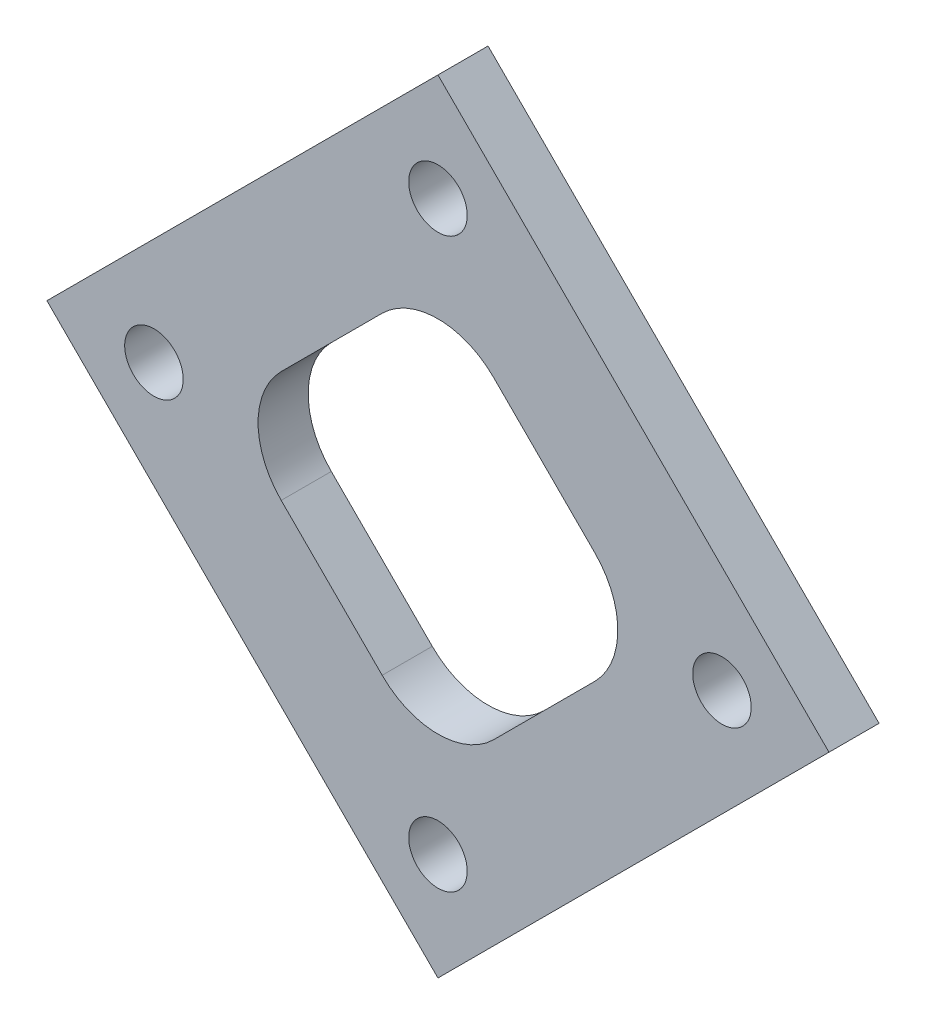
ISO-10303-21;
HEADER;
FILE_DESCRIPTION(('STEP AP214'),'2;1');
FILE_NAME('part.step','',(''),(''),'','','');
FILE_SCHEMA(('AUTOMOTIVE_DESIGN { 1 0 10303 214 1 1 1 1 }'));
ENDSEC;
DATA;
#1=APPLICATION_CONTEXT('core data for automotive mechanical design processes');
#2=APPLICATION_PROTOCOL_DEFINITION('international standard','automotive_design',2000,#1);
#3=PRODUCT_CONTEXT('',#1,'mechanical');
#4=PRODUCT('Part','Part','',(#3));
#5=PRODUCT_RELATED_PRODUCT_CATEGORY('part','',(#4));
#6=PRODUCT_DEFINITION_FORMATION('','',#4);
#7=PRODUCT_DEFINITION_CONTEXT('part definition',#1,'design');
#8=PRODUCT_DEFINITION('design','',#6,#7);
#9=PRODUCT_DEFINITION_SHAPE('','',#8);
#10=(LENGTH_UNIT() NAMED_UNIT(*) SI_UNIT(.MILLI.,.METRE.));
#11=(NAMED_UNIT(*) PLANE_ANGLE_UNIT() SI_UNIT($,.RADIAN.));
#12=(NAMED_UNIT(*) SI_UNIT($,.STERADIAN.) SOLID_ANGLE_UNIT());
#13=UNCERTAINTY_MEASURE_WITH_UNIT(LENGTH_MEASURE(1.E-05),#10,'distance_accuracy_value','');
#14=(GEOMETRIC_REPRESENTATION_CONTEXT(3) GLOBAL_UNCERTAINTY_ASSIGNED_CONTEXT((#13)) GLOBAL_UNIT_ASSIGNED_CONTEXT((#10,
#11,#12)) REPRESENTATION_CONTEXT('',''));
#15=CARTESIAN_POINT('',(0.,0.,0.));
#16=DIRECTION('',(0.,0.,1.));
#17=DIRECTION('',(1.,0.,0.));
#18=AXIS2_PLACEMENT_3D('',#15,#16,#17);
#19=CARTESIAN_POINT('',(0.,0.,3.175));
#20=DIRECTION('',(0.,0.,1.));
#21=DIRECTION('',(1.,0.,0.));
#22=AXIS2_PLACEMENT_3D('',#19,#20,#21);
#23=PLANE('',#22);
#24=CARTESIAN_POINT('',(0.,-18.,3.175));
#25=DIRECTION('',(0.,0.,1.));
#26=DIRECTION('',(1.,0.,0.));
#27=AXIS2_PLACEMENT_3D('',#24,#25,#26);
#28=CIRCLE('',#27,1.8542);
#29=CARTESIAN_POINT('',(1.8542,-18.,3.175));
#30=VERTEX_POINT('',#29);
#31=EDGE_CURVE('E298',#30,#30,#28,.T.);
#32=ORIENTED_EDGE('',*,*,#31,.F.);
#33=EDGE_LOOP('',(#32));
#34=FACE_BOUND('',#33,.T.);
#35=CARTESIAN_POINT('',(0.,18.,3.175));
#36=DIRECTION('',(0.,0.,1.));
#37=DIRECTION('',(1.,0.,0.));
#38=AXIS2_PLACEMENT_3D('',#35,#36,#37);
#39=CIRCLE('',#38,1.8542);
#40=CARTESIAN_POINT('',(1.8542,18.,3.175));
#41=VERTEX_POINT('',#40);
#42=EDGE_CURVE('E197',#41,#41,#39,.T.);
#43=ORIENTED_EDGE('',*,*,#42,.F.);
#44=EDGE_LOOP('',(#43));
#45=FACE_BOUND('',#44,.T.);
#46=DIRECTION('',(-0.707106781186548,-0.707106781186548,0.));
#47=VECTOR('',#46,1.);
#48=CARTESIAN_POINT('',(0.,24.7840926805885,3.175));
#49=LINE('',#48,#47);
#50=CARTESIAN_POINT('',(0.,24.7840926805885,3.175));
#51=VERTEX_POINT('',#50);
#52=CARTESIAN_POINT('',(-24.7840926805885,0.,3.175));
#53=VERTEX_POINT('',#52);
#54=EDGE_CURVE('E133',#51,#53,#49,.T.);
#55=ORIENTED_EDGE('',*,*,#54,.T.);
#56=DIRECTION('',(0.707106781186547,-0.707106781186548,0.));
#57=VECTOR('',#56,1.);
#58=CARTESIAN_POINT('',(-24.7840926805885,0.,3.175));
#59=LINE('',#58,#57);
#60=CARTESIAN_POINT('',(0.,-24.7840926805885,3.175));
#61=VERTEX_POINT('',#60);
#62=EDGE_CURVE('E122',#53,#61,#59,.T.);
#63=ORIENTED_EDGE('',*,*,#62,.T.);
#64=DIRECTION('',(0.707106781186547,0.707106781186548,0.));
#65=VECTOR('',#64,1.);
#66=CARTESIAN_POINT('',(24.7840926805885,0.,3.175));
#67=LINE('',#66,#65);
#68=CARTESIAN_POINT('',(24.7840926805885,0.,3.175));
#69=VERTEX_POINT('',#68);
#70=EDGE_CURVE('E132',#61,#69,#67,.T.);
#71=ORIENTED_EDGE('',*,*,#70,.T.);
#72=DIRECTION('',(-0.707106781186547,0.707106781186548,0.));
#73=VECTOR('',#72,1.);
#74=CARTESIAN_POINT('',(0.,24.7840926805885,3.175));
#75=LINE('',#74,#73);
#76=EDGE_CURVE('E137',#69,#51,#75,.T.);
#77=ORIENTED_EDGE('',*,*,#76,.T.);
#78=EDGE_LOOP('',(#55,#63,#71,#77));
#79=FACE_BOUND('',#78,.T.);
#80=DIRECTION('',(0.707106781186547,-0.707106781186548,0.));
#81=VECTOR('',#80,1.);
#82=CARTESIAN_POINT('',(-13.4703841816037,0.,3.175));
#83=LINE('',#82,#81);
#84=CARTESIAN_POINT('',(-9.93485027567099,-3.53553390593274,3.175));
#85=VERTEX_POINT('',#84);
#86=CARTESIAN_POINT('',(-3.53553390593274,-9.934850275671,3.175));
#87=VERTEX_POINT('',#86);
#88=EDGE_CURVE('E207',#85,#87,#83,.T.);
#89=ORIENTED_EDGE('',*,*,#88,.F.);
#90=CARTESIAN_POINT('',(-6.39931636973826,0.,3.175));
#91=DIRECTION('',(0.,0.,1.));
#92=DIRECTION('',(1.,0.,0.));
#93=AXIS2_PLACEMENT_3D('',#90,#91,#92);
#94=CIRCLE('',#93,5.);
#95=CARTESIAN_POINT('',(-9.93485027567099,3.53553390593274,3.175));
#96=VERTEX_POINT('',#95);
#97=EDGE_CURVE('E172',#85,#96,#94,.F.);
#98=ORIENTED_EDGE('',*,*,#97,.T.);
#99=DIRECTION('',(-0.707106781186547,-0.707106781186547,0.));
#100=VECTOR('',#99,1.);
#101=CARTESIAN_POINT('',(0.,13.4703841816037,3.175));
#102=LINE('',#101,#100);
#103=CARTESIAN_POINT('',(-3.53553390593274,9.93485027567099,3.175));
#104=VERTEX_POINT('',#103);
#105=EDGE_CURVE('E216',#104,#96,#102,.T.);
#106=ORIENTED_EDGE('',*,*,#105,.F.);
#107=CARTESIAN_POINT('',(0.,6.39931636973825,3.175));
#108=DIRECTION('',(0.,0.,1.));
#109=DIRECTION('',(1.,0.,0.));
#110=AXIS2_PLACEMENT_3D('',#107,#108,#109);
#111=CIRCLE('',#110,5.);
#112=CARTESIAN_POINT('',(3.53553390593274,9.93485027567099,3.175));
#113=VERTEX_POINT('',#112);
#114=EDGE_CURVE('E11',#104,#113,#111,.F.);
#115=ORIENTED_EDGE('',*,*,#114,.T.);
#116=DIRECTION('',(-0.707106781186547,0.707106781186548,0.));
#117=VECTOR('',#116,1.);
#118=CARTESIAN_POINT('',(0.,13.4703841816037,3.175));
#119=LINE('',#118,#117);
#120=CARTESIAN_POINT('',(9.93485027567099,3.53553390593274,3.175));
#121=VERTEX_POINT('',#120);
#122=EDGE_CURVE('E200',#121,#113,#119,.T.);
#123=ORIENTED_EDGE('',*,*,#122,.F.);
#124=CARTESIAN_POINT('',(6.39931636973825,0.,3.175));
#125=DIRECTION('',(0.,0.,1.));
#126=DIRECTION('',(1.,0.,0.));
#127=AXIS2_PLACEMENT_3D('',#124,#125,#126);
#128=CIRCLE('',#127,5.);
#129=CARTESIAN_POINT('',(9.93485027567099,-3.53553390593274,3.175));
#130=VERTEX_POINT('',#129);
#131=EDGE_CURVE('E180',#121,#130,#128,.F.);
#132=ORIENTED_EDGE('',*,*,#131,.T.);
#133=DIRECTION('',(0.707106781186547,0.707106781186548,0.));
#134=VECTOR('',#133,1.);
#135=CARTESIAN_POINT('',(13.4703841816037,0.,3.175));
#136=LINE('',#135,#134);
#137=CARTESIAN_POINT('',(3.53553390593274,-9.93485027567099,3.175));
#138=VERTEX_POINT('',#137);
#139=EDGE_CURVE('E202',#138,#130,#136,.T.);
#140=ORIENTED_EDGE('',*,*,#139,.F.);
#141=CARTESIAN_POINT('',(0.,-6.39931636973826,3.175));
#142=DIRECTION('',(0.,0.,1.));
#143=DIRECTION('',(1.,0.,0.));
#144=AXIS2_PLACEMENT_3D('',#141,#142,#143);
#145=CIRCLE('',#144,5.);
#146=EDGE_CURVE('E176',#138,#87,#145,.F.);
#147=ORIENTED_EDGE('',*,*,#146,.T.);
#148=EDGE_LOOP('',(#89,#98,#106,#115,#123,#132,#140,#147));
#149=FACE_BOUND('',#148,.T.);
#150=CARTESIAN_POINT('',(-18.,0.,3.175));
#151=DIRECTION('',(0.,0.,1.));
#152=DIRECTION('',(1.,0.,0.));
#153=AXIS2_PLACEMENT_3D('',#150,#151,#152);
#154=CIRCLE('',#153,1.8542);
#155=CARTESIAN_POINT('',(-16.1458,0.,3.175));
#156=VERTEX_POINT('',#155);
#157=EDGE_CURVE('E304',#156,#156,#154,.T.);
#158=ORIENTED_EDGE('',*,*,#157,.F.);
#159=EDGE_LOOP('',(#158));
#160=FACE_BOUND('',#159,.T.);
#161=CARTESIAN_POINT('',(18.,0.,3.175));
#162=DIRECTION('',(0.,0.,1.));
#163=DIRECTION('',(1.,0.,0.));
#164=AXIS2_PLACEMENT_3D('',#161,#162,#163);
#165=CIRCLE('',#164,1.8542);
#166=CARTESIAN_POINT('',(19.8542,0.,3.175));
#167=VERTEX_POINT('',#166);
#168=EDGE_CURVE('E289',#167,#167,#165,.T.);
#169=ORIENTED_EDGE('',*,*,#168,.F.);
#170=EDGE_LOOP('',(#169));
#171=FACE_BOUND('',#170,.T.);
#172=ADVANCED_FACE('F33',(#34,#45,#79,#149,#160,#171),#23,.T.);
#173=CARTESIAN_POINT('',(0.,0.,0.));
#174=DIRECTION('',(0.,0.,1.));
#175=DIRECTION('',(1.,0.,0.));
#176=AXIS2_PLACEMENT_3D('',#173,#174,#175);
#177=PLANE('',#176);
#178=DIRECTION('',(-0.707106781186548,-0.707106781186548,0.));
#179=VECTOR('',#178,1.);
#180=CARTESIAN_POINT('',(0.,24.7840926805885,0.));
#181=LINE('',#180,#179);
#182=CARTESIAN_POINT('',(0.,24.7840926805885,0.));
#183=VERTEX_POINT('',#182);
#184=CARTESIAN_POINT('',(-24.7840926805885,0.,0.));
#185=VERTEX_POINT('',#184);
#186=EDGE_CURVE('E145',#183,#185,#181,.T.);
#187=ORIENTED_EDGE('',*,*,#186,.F.);
#188=DIRECTION('',(-0.707106781186547,0.707106781186548,0.));
#189=VECTOR('',#188,1.);
#190=CARTESIAN_POINT('',(0.,24.7840926805885,0.));
#191=LINE('',#190,#189);
#192=CARTESIAN_POINT('',(24.7840926805885,0.,0.));
#193=VERTEX_POINT('',#192);
#194=EDGE_CURVE('E141',#193,#183,#191,.T.);
#195=ORIENTED_EDGE('',*,*,#194,.F.);
#196=DIRECTION('',(0.707106781186547,0.707106781186548,0.));
#197=VECTOR('',#196,1.);
#198=CARTESIAN_POINT('',(24.7840926805885,0.,0.));
#199=LINE('',#198,#197);
#200=CARTESIAN_POINT('',(0.,-24.7840926805885,0.));
#201=VERTEX_POINT('',#200);
#202=EDGE_CURVE('E222',#201,#193,#199,.T.);
#203=ORIENTED_EDGE('',*,*,#202,.F.);
#204=DIRECTION('',(0.707106781186547,-0.707106781186548,0.));
#205=VECTOR('',#204,1.);
#206=CARTESIAN_POINT('',(-24.7840926805885,0.,0.));
#207=LINE('',#206,#205);
#208=EDGE_CURVE('E204',#185,#201,#207,.T.);
#209=ORIENTED_EDGE('',*,*,#208,.F.);
#210=EDGE_LOOP('',(#187,#195,#203,#209));
#211=FACE_BOUND('',#210,.T.);
#212=DIRECTION('',(-0.707106781186547,0.707106781186548,0.));
#213=VECTOR('',#212,1.);
#214=CARTESIAN_POINT('',(0.,13.4703841816037,0.));
#215=LINE('',#214,#213);
#216=CARTESIAN_POINT('',(9.93485027567099,3.53553390593274,0.));
#217=VERTEX_POINT('',#216);
#218=CARTESIAN_POINT('',(3.53553390593274,9.93485027567099,0.));
#219=VERTEX_POINT('',#218);
#220=EDGE_CURVE('E188',#217,#219,#215,.T.);
#221=ORIENTED_EDGE('',*,*,#220,.T.);
#222=CARTESIAN_POINT('',(0.,6.39931636973825,0.));
#223=DIRECTION('',(0.,0.,1.));
#224=DIRECTION('',(1.,0.,0.));
#225=AXIS2_PLACEMENT_3D('',#222,#223,#224);
#226=CIRCLE('',#225,5.);
#227=CARTESIAN_POINT('',(-3.53553390593274,9.93485027567099,0.));
#228=VERTEX_POINT('',#227);
#229=EDGE_CURVE('E41',#219,#228,#226,.T.);
#230=ORIENTED_EDGE('',*,*,#229,.T.);
#231=DIRECTION('',(-0.707106781186547,-0.707106781186547,0.));
#232=VECTOR('',#231,1.);
#233=CARTESIAN_POINT('',(0.,13.4703841816037,0.));
#234=LINE('',#233,#232);
#235=CARTESIAN_POINT('',(-9.93485027567099,3.53553390593274,0.));
#236=VERTEX_POINT('',#235);
#237=EDGE_CURVE('E187',#228,#236,#234,.T.);
#238=ORIENTED_EDGE('',*,*,#237,.T.);
#239=CARTESIAN_POINT('',(-6.39931636973826,0.,0.));
#240=DIRECTION('',(0.,0.,1.));
#241=DIRECTION('',(1.,0.,0.));
#242=AXIS2_PLACEMENT_3D('',#239,#240,#241);
#243=CIRCLE('',#242,5.);
#244=CARTESIAN_POINT('',(-9.93485027567099,-3.53553390593274,0.));
#245=VERTEX_POINT('',#244);
#246=EDGE_CURVE('E170',#236,#245,#243,.T.);
#247=ORIENTED_EDGE('',*,*,#246,.T.);
#248=DIRECTION('',(0.707106781186547,-0.707106781186548,0.));
#249=VECTOR('',#248,1.);
#250=CARTESIAN_POINT('',(-13.4703841816037,0.,0.));
#251=LINE('',#250,#249);
#252=CARTESIAN_POINT('',(-3.53553390593274,-9.934850275671,0.));
#253=VERTEX_POINT('',#252);
#254=EDGE_CURVE('E196',#245,#253,#251,.T.);
#255=ORIENTED_EDGE('',*,*,#254,.T.);
#256=CARTESIAN_POINT('',(0.,-6.39931636973826,0.));
#257=DIRECTION('',(0.,0.,1.));
#258=DIRECTION('',(1.,0.,0.));
#259=AXIS2_PLACEMENT_3D('',#256,#257,#258);
#260=CIRCLE('',#259,5.);
#261=CARTESIAN_POINT('',(3.53553390593274,-9.93485027567099,0.));
#262=VERTEX_POINT('',#261);
#263=EDGE_CURVE('E174',#253,#262,#260,.T.);
#264=ORIENTED_EDGE('',*,*,#263,.T.);
#265=DIRECTION('',(0.707106781186547,0.707106781186548,0.));
#266=VECTOR('',#265,1.);
#267=CARTESIAN_POINT('',(13.4703841816037,0.,0.));
#268=LINE('',#267,#266);
#269=CARTESIAN_POINT('',(9.93485027567099,-3.53553390593274,0.));
#270=VERTEX_POINT('',#269);
#271=EDGE_CURVE('E213',#262,#270,#268,.T.);
#272=ORIENTED_EDGE('',*,*,#271,.T.);
#273=CARTESIAN_POINT('',(6.39931636973825,0.,0.));
#274=DIRECTION('',(0.,0.,1.));
#275=DIRECTION('',(1.,0.,0.));
#276=AXIS2_PLACEMENT_3D('',#273,#274,#275);
#277=CIRCLE('',#276,5.);
#278=EDGE_CURVE('E178',#270,#217,#277,.T.);
#279=ORIENTED_EDGE('',*,*,#278,.T.);
#280=EDGE_LOOP('',(#221,#230,#238,#247,#255,#264,#272,#279));
#281=FACE_BOUND('',#280,.T.);
#282=CARTESIAN_POINT('',(0.,18.,0.));
#283=DIRECTION('',(0.,0.,1.));
#284=DIRECTION('',(1.,0.,0.));
#285=AXIS2_PLACEMENT_3D('',#282,#283,#284);
#286=CIRCLE('',#285,1.8542);
#287=CARTESIAN_POINT('',(1.8542,18.,0.));
#288=VERTEX_POINT('',#287);
#289=EDGE_CURVE('E307',#288,#288,#286,.T.);
#290=ORIENTED_EDGE('',*,*,#289,.T.);
#291=EDGE_LOOP('',(#290));
#292=FACE_BOUND('',#291,.T.);
#293=CARTESIAN_POINT('',(-18.,0.,0.));
#294=DIRECTION('',(0.,0.,1.));
#295=DIRECTION('',(1.,0.,0.));
#296=AXIS2_PLACEMENT_3D('',#293,#294,#295);
#297=CIRCLE('',#296,1.8542);
#298=CARTESIAN_POINT('',(-16.1458,0.,0.));
#299=VERTEX_POINT('',#298);
#300=EDGE_CURVE('E301',#299,#299,#297,.T.);
#301=ORIENTED_EDGE('',*,*,#300,.T.);
#302=EDGE_LOOP('',(#301));
#303=FACE_BOUND('',#302,.T.);
#304=CARTESIAN_POINT('',(0.,-18.,0.));
#305=DIRECTION('',(0.,0.,1.));
#306=DIRECTION('',(1.,0.,0.));
#307=AXIS2_PLACEMENT_3D('',#304,#305,#306);
#308=CIRCLE('',#307,1.8542);
#309=CARTESIAN_POINT('',(1.8542,-18.,0.));
#310=VERTEX_POINT('',#309);
#311=EDGE_CURVE('E295',#310,#310,#308,.T.);
#312=ORIENTED_EDGE('',*,*,#311,.T.);
#313=EDGE_LOOP('',(#312));
#314=FACE_BOUND('',#313,.T.);
#315=CARTESIAN_POINT('',(18.,0.,0.));
#316=DIRECTION('',(0.,0.,1.));
#317=DIRECTION('',(1.,0.,0.));
#318=AXIS2_PLACEMENT_3D('',#315,#316,#317);
#319=CIRCLE('',#318,1.8542);
#320=CARTESIAN_POINT('',(19.8542,0.,0.));
#321=VERTEX_POINT('',#320);
#322=EDGE_CURVE('E292',#321,#321,#319,.T.);
#323=ORIENTED_EDGE('',*,*,#322,.T.);
#324=EDGE_LOOP('',(#323));
#325=FACE_BOUND('',#324,.T.);
#326=ADVANCED_FACE('F185',(#211,#281,#292,#303,#314,#325),#177,.F.);
#327=CARTESIAN_POINT('',(0.,24.7840926805885,3.175));
#328=DIRECTION('',(0.707106781186548,-0.707106781186548,0.));
#329=DIRECTION('',(0.707106781186548,0.707106781186548,0.));
#330=AXIS2_PLACEMENT_3D('',#327,#328,#329);
#331=PLANE('',#330);
#332=ORIENTED_EDGE('',*,*,#186,.T.);
#333=DIRECTION('',(0.,0.,-1.));
#334=VECTOR('',#333,1.);
#335=CARTESIAN_POINT('',(-24.7840926805885,0.,3.175));
#336=LINE('',#335,#334);
#337=EDGE_CURVE('E126',#53,#185,#336,.T.);
#338=ORIENTED_EDGE('',*,*,#337,.F.);
#339=ORIENTED_EDGE('',*,*,#54,.F.);
#340=DIRECTION('',(0.,0.,-1.));
#341=VECTOR('',#340,1.);
#342=CARTESIAN_POINT('',(0.,24.7840926805885,3.175));
#343=LINE('',#342,#341);
#344=EDGE_CURVE('E219',#51,#183,#343,.T.);
#345=ORIENTED_EDGE('',*,*,#344,.T.);
#346=EDGE_LOOP('',(#332,#338,#339,#345));
#347=FACE_BOUND('',#346,.T.);
#348=ADVANCED_FACE('F143',(#347),#331,.F.);
#349=CARTESIAN_POINT('',(-24.7840926805885,0.,3.175));
#350=DIRECTION('',(0.707106781186548,0.707106781186547,0.));
#351=DIRECTION('',(-0.707106781186547,0.707106781186548,0.));
#352=AXIS2_PLACEMENT_3D('',#349,#350,#351);
#353=PLANE('',#352);
#354=ORIENTED_EDGE('',*,*,#208,.T.);
#355=DIRECTION('',(0.,0.,-1.));
#356=VECTOR('',#355,1.);
#357=CARTESIAN_POINT('',(0.,-24.7840926805885,3.175));
#358=LINE('',#357,#356);
#359=EDGE_CURVE('E129',#61,#201,#358,.T.);
#360=ORIENTED_EDGE('',*,*,#359,.F.);
#361=ORIENTED_EDGE('',*,*,#62,.F.);
#362=ORIENTED_EDGE('',*,*,#337,.T.);
#363=EDGE_LOOP('',(#354,#360,#361,#362));
#364=FACE_BOUND('',#363,.T.);
#365=ADVANCED_FACE('F124',(#364),#353,.F.);
#366=CARTESIAN_POINT('',(24.7840926805885,0.,3.175));
#367=DIRECTION('',(-0.707106781186548,0.707106781186547,0.));
#368=DIRECTION('',(-0.707106781186547,-0.707106781186548,0.));
#369=AXIS2_PLACEMENT_3D('',#366,#367,#368);
#370=PLANE('',#369);
#371=ORIENTED_EDGE('',*,*,#202,.T.);
#372=DIRECTION('',(0.,0.,-1.));
#373=VECTOR('',#372,1.);
#374=CARTESIAN_POINT('',(24.7840926805885,0.,3.175));
#375=LINE('',#374,#373);
#376=EDGE_CURVE('E150',#69,#193,#375,.T.);
#377=ORIENTED_EDGE('',*,*,#376,.F.);
#378=ORIENTED_EDGE('',*,*,#70,.F.);
#379=ORIENTED_EDGE('',*,*,#359,.T.);
#380=EDGE_LOOP('',(#371,#377,#378,#379));
#381=FACE_BOUND('',#380,.T.);
#382=ADVANCED_FACE('F233',(#381),#370,.F.);
#383=CARTESIAN_POINT('',(0.,24.7840926805885,3.175));
#384=DIRECTION('',(-0.707106781186548,-0.707106781186547,0.));
#385=DIRECTION('',(0.707106781186547,-0.707106781186548,0.));
#386=AXIS2_PLACEMENT_3D('',#383,#384,#385);
#387=PLANE('',#386);
#388=ORIENTED_EDGE('',*,*,#194,.T.);
#389=ORIENTED_EDGE('',*,*,#344,.F.);
#390=ORIENTED_EDGE('',*,*,#76,.F.);
#391=ORIENTED_EDGE('',*,*,#376,.T.);
#392=EDGE_LOOP('',(#388,#389,#390,#391));
#393=FACE_BOUND('',#392,.T.);
#394=ADVANCED_FACE('F229',(#393),#387,.F.);
#395=CARTESIAN_POINT('',(0.,13.4703841816037,3.175));
#396=DIRECTION('',(0.707106781186548,-0.707106781186548,0.));
#397=DIRECTION('',(0.707106781186548,0.707106781186548,0.));
#398=AXIS2_PLACEMENT_3D('',#395,#396,#397);
#399=PLANE('',#398);
#400=ORIENTED_EDGE('',*,*,#105,.T.);
#401=DIRECTION('',(0.,0.,-1.));
#402=VECTOR('',#401,1.);
#403=CARTESIAN_POINT('',(-9.934850275671,3.53553390593274,0.));
#404=LINE('',#403,#402);
#405=EDGE_CURVE('E148',#96,#236,#404,.T.);
#406=ORIENTED_EDGE('',*,*,#405,.T.);
#407=ORIENTED_EDGE('',*,*,#237,.F.);
#408=DIRECTION('',(0.,0.,-1.));
#409=VECTOR('',#408,1.);
#410=CARTESIAN_POINT('',(-3.53553390593274,9.93485027567099,3.175));
#411=LINE('',#410,#409);
#412=EDGE_CURVE('E146',#228,#104,#411,.F.);
#413=ORIENTED_EDGE('',*,*,#412,.T.);
#414=EDGE_LOOP('',(#400,#406,#407,#413));
#415=FACE_BOUND('',#414,.T.);
#416=ADVANCED_FACE('F194',(#415),#399,.T.);
#417=CARTESIAN_POINT('',(-13.4703841816037,0.,3.175));
#418=DIRECTION('',(0.707106781186548,0.707106781186547,0.));
#419=DIRECTION('',(-0.707106781186547,0.707106781186548,0.));
#420=AXIS2_PLACEMENT_3D('',#417,#418,#419);
#421=PLANE('',#420);
#422=ORIENTED_EDGE('',*,*,#254,.F.);
#423=DIRECTION('',(0.,0.,-1.));
#424=VECTOR('',#423,1.);
#425=CARTESIAN_POINT('',(-9.934850275671,-3.53553390593274,3.175));
#426=LINE('',#425,#424);
#427=EDGE_CURVE('E159',#245,#85,#426,.F.);
#428=ORIENTED_EDGE('',*,*,#427,.T.);
#429=ORIENTED_EDGE('',*,*,#88,.T.);
#430=DIRECTION('',(0.,0.,-1.));
#431=VECTOR('',#430,1.);
#432=CARTESIAN_POINT('',(-3.53553390593274,-9.93485027567099,0.));
#433=LINE('',#432,#431);
#434=EDGE_CURVE('E156',#87,#253,#433,.T.);
#435=ORIENTED_EDGE('',*,*,#434,.T.);
#436=EDGE_LOOP('',(#422,#428,#429,#435));
#437=FACE_BOUND('',#436,.T.);
#438=ADVANCED_FACE('F254',(#437),#421,.T.);
#439=CARTESIAN_POINT('',(13.4703841816037,0.,3.175));
#440=DIRECTION('',(-0.707106781186548,0.707106781186547,0.));
#441=DIRECTION('',(-0.707106781186547,-0.707106781186548,0.));
#442=AXIS2_PLACEMENT_3D('',#439,#440,#441);
#443=PLANE('',#442);
#444=ORIENTED_EDGE('',*,*,#271,.F.);
#445=DIRECTION('',(0.,0.,-1.));
#446=VECTOR('',#445,1.);
#447=CARTESIAN_POINT('',(3.53553390593273,-9.93485027567099,3.175));
#448=LINE('',#447,#446);
#449=EDGE_CURVE('E164',#262,#138,#448,.F.);
#450=ORIENTED_EDGE('',*,*,#449,.T.);
#451=ORIENTED_EDGE('',*,*,#139,.T.);
#452=DIRECTION('',(0.,0.,-1.));
#453=VECTOR('',#452,1.);
#454=CARTESIAN_POINT('',(9.93485027567099,-3.53553390593274,0.));
#455=LINE('',#454,#453);
#456=EDGE_CURVE('E161',#130,#270,#455,.T.);
#457=ORIENTED_EDGE('',*,*,#456,.T.);
#458=EDGE_LOOP('',(#444,#450,#451,#457));
#459=FACE_BOUND('',#458,.T.);
#460=ADVANCED_FACE('F257',(#459),#443,.T.);
#461=CARTESIAN_POINT('',(0.,13.4703841816037,3.175));
#462=DIRECTION('',(-0.707106781186548,-0.707106781186547,0.));
#463=DIRECTION('',(0.707106781186547,-0.707106781186548,0.));
#464=AXIS2_PLACEMENT_3D('',#461,#462,#463);
#465=PLANE('',#464);
#466=ORIENTED_EDGE('',*,*,#220,.F.);
#467=DIRECTION('',(0.,0.,-1.));
#468=VECTOR('',#467,1.);
#469=CARTESIAN_POINT('',(9.93485027567099,3.53553390593274,3.175));
#470=LINE('',#469,#468);
#471=EDGE_CURVE('E53',#217,#121,#470,.F.);
#472=ORIENTED_EDGE('',*,*,#471,.T.);
#473=ORIENTED_EDGE('',*,*,#122,.T.);
#474=DIRECTION('',(0.,0.,-1.));
#475=VECTOR('',#474,1.);
#476=CARTESIAN_POINT('',(3.53553390593274,9.93485027567099,0.));
#477=LINE('',#476,#475);
#478=EDGE_CURVE('E166',#113,#219,#477,.T.);
#479=ORIENTED_EDGE('',*,*,#478,.T.);
#480=EDGE_LOOP('',(#466,#472,#473,#479));
#481=FACE_BOUND('',#480,.T.);
#482=ADVANCED_FACE('F199',(#481),#465,.T.);
#483=CARTESIAN_POINT('',(0.,18.,3.175));
#484=DIRECTION('',(0.,0.,-1.));
#485=DIRECTION('',(-1.,0.,0.));
#486=AXIS2_PLACEMENT_3D('',#483,#484,#485);
#487=CYLINDRICAL_SURFACE('',#486,1.8542);
#488=ORIENTED_EDGE('',*,*,#42,.T.);
#489=EDGE_LOOP('',(#488));
#490=FACE_BOUND('',#489,.T.);
#491=ORIENTED_EDGE('',*,*,#289,.F.);
#492=EDGE_LOOP('',(#491));
#493=FACE_BOUND('',#492,.T.);
#494=ADVANCED_FACE('F264',(#490,#493),#487,.F.);
#495=CARTESIAN_POINT('',(-18.,0.,3.175));
#496=DIRECTION('',(0.,0.,-1.));
#497=DIRECTION('',(-1.,0.,0.));
#498=AXIS2_PLACEMENT_3D('',#495,#496,#497);
#499=CYLINDRICAL_SURFACE('',#498,1.8542);
#500=ORIENTED_EDGE('',*,*,#157,.T.);
#501=EDGE_LOOP('',(#500));
#502=FACE_BOUND('',#501,.T.);
#503=ORIENTED_EDGE('',*,*,#300,.F.);
#504=EDGE_LOOP('',(#503));
#505=FACE_BOUND('',#504,.T.);
#506=ADVANCED_FACE('F267',(#502,#505),#499,.F.);
#507=CARTESIAN_POINT('',(0.,-18.,3.175));
#508=DIRECTION('',(0.,0.,-1.));
#509=DIRECTION('',(-1.,0.,0.));
#510=AXIS2_PLACEMENT_3D('',#507,#508,#509);
#511=CYLINDRICAL_SURFACE('',#510,1.8542);
#512=ORIENTED_EDGE('',*,*,#31,.T.);
#513=EDGE_LOOP('',(#512));
#514=FACE_BOUND('',#513,.T.);
#515=ORIENTED_EDGE('',*,*,#311,.F.);
#516=EDGE_LOOP('',(#515));
#517=FACE_BOUND('',#516,.T.);
#518=ADVANCED_FACE('F271',(#514,#517),#511,.F.);
#519=CARTESIAN_POINT('',(18.,0.,3.175));
#520=DIRECTION('',(0.,0.,-1.));
#521=DIRECTION('',(-1.,0.,0.));
#522=AXIS2_PLACEMENT_3D('',#519,#520,#521);
#523=CYLINDRICAL_SURFACE('',#522,1.8542);
#524=ORIENTED_EDGE('',*,*,#168,.T.);
#525=EDGE_LOOP('',(#524));
#526=FACE_BOUND('',#525,.T.);
#527=ORIENTED_EDGE('',*,*,#322,.F.);
#528=EDGE_LOOP('',(#527));
#529=FACE_BOUND('',#528,.T.);
#530=ADVANCED_FACE('F275',(#526,#529),#523,.F.);
#531=CARTESIAN_POINT('',(-6.39931636973826,0.,3.175));
#532=DIRECTION('',(0.,0.,1.));
#533=DIRECTION('',(1.,0.,0.));
#534=AXIS2_PLACEMENT_3D('',#531,#532,#533);
#535=CYLINDRICAL_SURFACE('',#534,5.);
#536=ORIENTED_EDGE('',*,*,#97,.F.);
#537=ORIENTED_EDGE('',*,*,#427,.F.);
#538=ORIENTED_EDGE('',*,*,#246,.F.);
#539=ORIENTED_EDGE('',*,*,#405,.F.);
#540=EDGE_LOOP('',(#536,#537,#538,#539));
#541=FACE_BOUND('',#540,.T.);
#542=ADVANCED_FACE('F278',(#541),#535,.F.);
#543=CARTESIAN_POINT('',(0.,-6.39931636973826,3.175));
#544=DIRECTION('',(0.,0.,1.));
#545=DIRECTION('',(1.,0.,0.));
#546=AXIS2_PLACEMENT_3D('',#543,#544,#545);
#547=CYLINDRICAL_SURFACE('',#546,5.);
#548=ORIENTED_EDGE('',*,*,#146,.F.);
#549=ORIENTED_EDGE('',*,*,#449,.F.);
#550=ORIENTED_EDGE('',*,*,#263,.F.);
#551=ORIENTED_EDGE('',*,*,#434,.F.);
#552=EDGE_LOOP('',(#548,#549,#550,#551));
#553=FACE_BOUND('',#552,.T.);
#554=ADVANCED_FACE('F283',(#553),#547,.F.);
#555=CARTESIAN_POINT('',(6.39931636973825,0.,3.175));
#556=DIRECTION('',(0.,0.,1.));
#557=DIRECTION('',(1.,0.,0.));
#558=AXIS2_PLACEMENT_3D('',#555,#556,#557);
#559=CYLINDRICAL_SURFACE('',#558,5.);
#560=ORIENTED_EDGE('',*,*,#131,.F.);
#561=ORIENTED_EDGE('',*,*,#471,.F.);
#562=ORIENTED_EDGE('',*,*,#278,.F.);
#563=ORIENTED_EDGE('',*,*,#456,.F.);
#564=EDGE_LOOP('',(#560,#561,#562,#563));
#565=FACE_BOUND('',#564,.T.);
#566=ADVANCED_FACE('F327',(#565),#559,.F.);
#567=CARTESIAN_POINT('',(0.,6.39931636973825,3.175));
#568=DIRECTION('',(0.,0.,1.));
#569=DIRECTION('',(1.,0.,0.));
#570=AXIS2_PLACEMENT_3D('',#567,#568,#569);
#571=CYLINDRICAL_SURFACE('',#570,5.);
#572=ORIENTED_EDGE('',*,*,#114,.F.);
#573=ORIENTED_EDGE('',*,*,#412,.F.);
#574=ORIENTED_EDGE('',*,*,#229,.F.);
#575=ORIENTED_EDGE('',*,*,#478,.F.);
#576=EDGE_LOOP('',(#572,#573,#574,#575));
#577=FACE_BOUND('',#576,.T.);
#578=ADVANCED_FACE('F35',(#577),#571,.F.);
#579=CLOSED_SHELL('',(#172,#326,#348,#365,#382,#394,#416,#438,#460,#482,#494,#506,#518,#530,
#542,#554,#566,#578));
#580=MANIFOLD_SOLID_BREP('B2',#579);
#581=ADVANCED_BREP_SHAPE_REPRESENTATION('',(#18,#580),#14);
#582=SHAPE_DEFINITION_REPRESENTATION(#9,#581);
ENDSEC;
END-ISO-10303-21;
